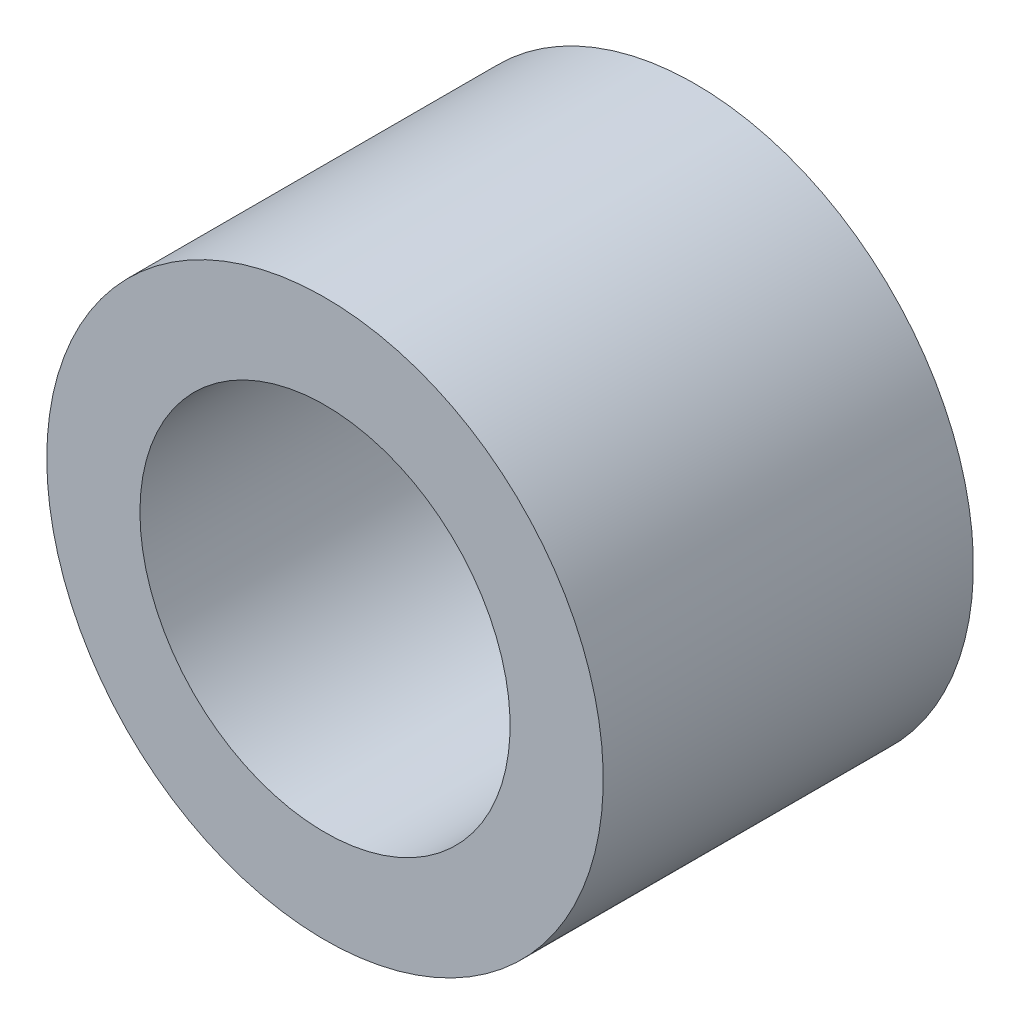
ISO-10303-21;
HEADER;
FILE_DESCRIPTION(('STEP AP214'),'2;1');
FILE_NAME('part.step','',(''),(''),'','','');
FILE_SCHEMA(('AUTOMOTIVE_DESIGN { 1 0 10303 214 1 1 1 1 }'));
ENDSEC;
DATA;
#1=APPLICATION_CONTEXT('core data for automotive mechanical design processes');
#2=APPLICATION_PROTOCOL_DEFINITION('international standard','automotive_design',2000,#1);
#3=PRODUCT_CONTEXT('',#1,'mechanical');
#4=PRODUCT('Part','Part','',(#3));
#5=PRODUCT_RELATED_PRODUCT_CATEGORY('part','',(#4));
#6=PRODUCT_DEFINITION_FORMATION('','',#4);
#7=PRODUCT_DEFINITION_CONTEXT('part definition',#1,'design');
#8=PRODUCT_DEFINITION('design','',#6,#7);
#9=PRODUCT_DEFINITION_SHAPE('','',#8);
#10=(LENGTH_UNIT() NAMED_UNIT(*) SI_UNIT(.MILLI.,.METRE.));
#11=(NAMED_UNIT(*) PLANE_ANGLE_UNIT() SI_UNIT($,.RADIAN.));
#12=(NAMED_UNIT(*) SI_UNIT($,.STERADIAN.) SOLID_ANGLE_UNIT());
#13=UNCERTAINTY_MEASURE_WITH_UNIT(LENGTH_MEASURE(1.E-05),#10,'distance_accuracy_value','');
#14=(GEOMETRIC_REPRESENTATION_CONTEXT(3) GLOBAL_UNCERTAINTY_ASSIGNED_CONTEXT((#13)) GLOBAL_UNIT_ASSIGNED_CONTEXT((#10,
#11,#12)) REPRESENTATION_CONTEXT('',''));
#15=CARTESIAN_POINT('',(0.,0.,0.));
#16=DIRECTION('',(0.,0.,1.));
#17=DIRECTION('',(1.,0.,0.));
#18=AXIS2_PLACEMENT_3D('',#15,#16,#17);
#19=CARTESIAN_POINT('',(0.,0.,3.));
#20=DIRECTION('',(0.,0.,-1.));
#21=DIRECTION('',(-1.,0.,0.));
#22=AXIS2_PLACEMENT_3D('',#19,#20,#21);
#23=CYLINDRICAL_SURFACE('',#22,4.51);
#24=CARTESIAN_POINT('',(0.,0.,3.));
#25=DIRECTION('',(0.,0.,-1.));
#26=DIRECTION('',(-1.,0.,0.));
#27=AXIS2_PLACEMENT_3D('',#24,#25,#26);
#28=CIRCLE('',#27,4.51);
#29=CARTESIAN_POINT('',(-4.51,0.,3.));
#30=VERTEX_POINT('',#29);
#31=EDGE_CURVE('E10',#30,#30,#28,.T.);
#32=ORIENTED_EDGE('',*,*,#31,.T.);
#33=EDGE_LOOP('',(#32));
#34=FACE_BOUND('',#33,.T.);
#35=CARTESIAN_POINT('',(0.,0.,-3.));
#36=DIRECTION('',(0.,0.,-1.));
#37=DIRECTION('',(-1.,0.,0.));
#38=AXIS2_PLACEMENT_3D('',#35,#36,#37);
#39=CIRCLE('',#38,4.51);
#40=CARTESIAN_POINT('',(-4.51,0.,-3.));
#41=VERTEX_POINT('',#40);
#42=EDGE_CURVE('E45',#41,#41,#39,.T.);
#43=ORIENTED_EDGE('',*,*,#42,.F.);
#44=EDGE_LOOP('',(#43));
#45=FACE_BOUND('',#44,.T.);
#46=ADVANCED_FACE('F31',(#34,#45),#23,.T.);
#47=CARTESIAN_POINT('',(4.51,0.,3.));
#48=DIRECTION('',(0.,0.,1.));
#49=DIRECTION('',(1.,0.,0.));
#50=AXIS2_PLACEMENT_3D('',#47,#48,#49);
#51=PLANE('',#50);
#52=CARTESIAN_POINT('',(0.,0.,3.));
#53=DIRECTION('',(0.,0.,-1.));
#54=DIRECTION('',(-1.,0.,0.));
#55=AXIS2_PLACEMENT_3D('',#52,#53,#54);
#56=CIRCLE('',#55,3.);
#57=CARTESIAN_POINT('',(-3.,0.,3.));
#58=VERTEX_POINT('',#57);
#59=EDGE_CURVE('E37',#58,#58,#56,.T.);
#60=ORIENTED_EDGE('',*,*,#59,.T.);
#61=EDGE_LOOP('',(#60));
#62=FACE_BOUND('',#61,.T.);
#63=ORIENTED_EDGE('',*,*,#31,.F.);
#64=EDGE_LOOP('',(#63));
#65=FACE_BOUND('',#64,.T.);
#66=ADVANCED_FACE('F55',(#62,#65),#51,.T.);
#67=CARTESIAN_POINT('',(0.,0.,3.));
#68=DIRECTION('',(0.,0.,-1.));
#69=DIRECTION('',(-1.,0.,0.));
#70=AXIS2_PLACEMENT_3D('',#67,#68,#69);
#71=CYLINDRICAL_SURFACE('',#70,3.);
#72=CARTESIAN_POINT('',(0.,0.,-3.));
#73=DIRECTION('',(0.,0.,-1.));
#74=DIRECTION('',(-1.,0.,0.));
#75=AXIS2_PLACEMENT_3D('',#72,#73,#74);
#76=CIRCLE('',#75,3.);
#77=CARTESIAN_POINT('',(-3.,0.,-3.));
#78=VERTEX_POINT('',#77);
#79=EDGE_CURVE('E41',#78,#78,#76,.T.);
#80=ORIENTED_EDGE('',*,*,#79,.T.);
#81=EDGE_LOOP('',(#80));
#82=FACE_BOUND('',#81,.T.);
#83=ORIENTED_EDGE('',*,*,#59,.F.);
#84=EDGE_LOOP('',(#83));
#85=FACE_BOUND('',#84,.T.);
#86=ADVANCED_FACE('F59',(#82,#85),#71,.F.);
#87=CARTESIAN_POINT('',(3.,0.,-3.));
#88=DIRECTION('',(0.,0.,-1.));
#89=DIRECTION('',(-1.,0.,0.));
#90=AXIS2_PLACEMENT_3D('',#87,#88,#89);
#91=PLANE('',#90);
#92=ORIENTED_EDGE('',*,*,#42,.T.);
#93=EDGE_LOOP('',(#92));
#94=FACE_BOUND('',#93,.T.);
#95=ORIENTED_EDGE('',*,*,#79,.F.);
#96=EDGE_LOOP('',(#95));
#97=FACE_BOUND('',#96,.T.);
#98=ADVANCED_FACE('F51',(#94,#97),#91,.T.);
#99=CLOSED_SHELL('',(#46,#66,#86,#98));
#100=MANIFOLD_SOLID_BREP('B2',#99);
#101=ADVANCED_BREP_SHAPE_REPRESENTATION('',(#18,#100),#14);
#102=SHAPE_DEFINITION_REPRESENTATION(#9,#101);
ENDSEC;
END-ISO-10303-21;
